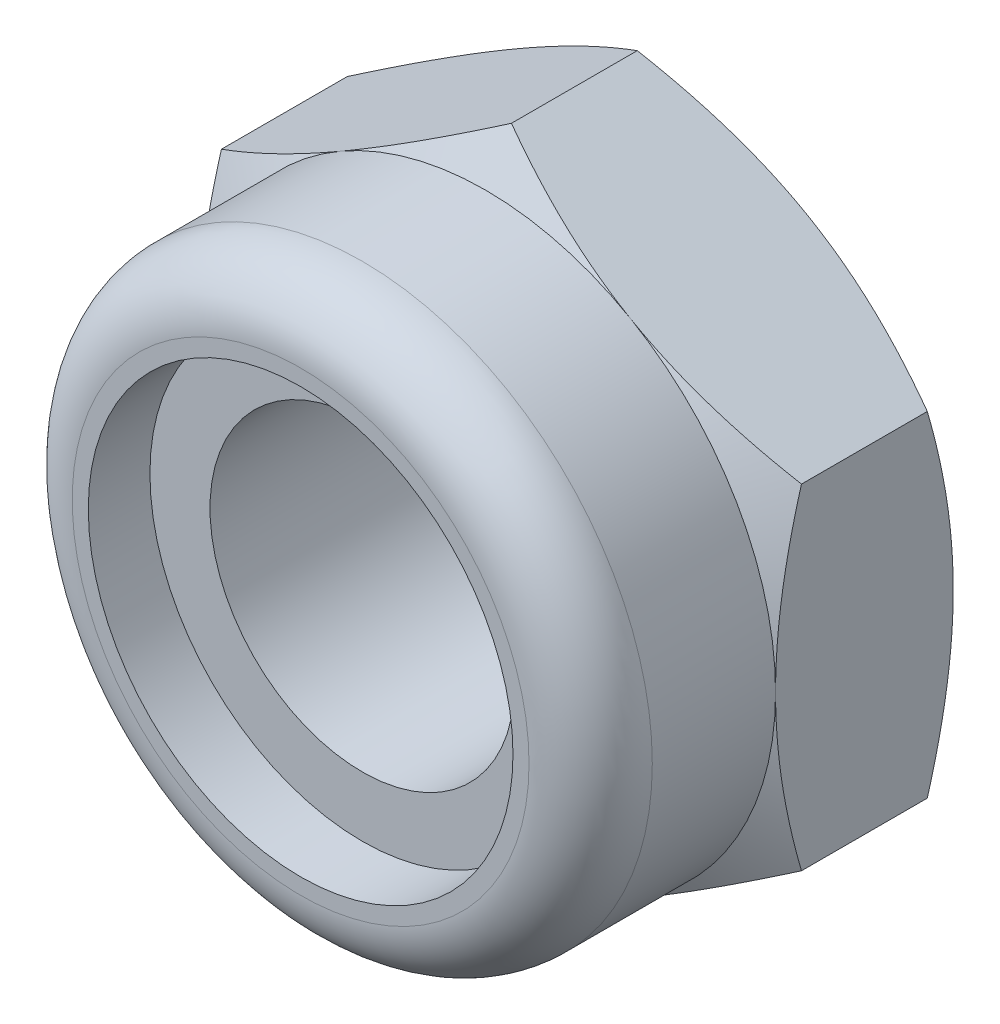
ISO-10303-21;
HEADER;
FILE_DESCRIPTION(('STEP AP214'),'2;1');
FILE_NAME('part.step','',(''),(''),'','','');
FILE_SCHEMA(('AUTOMOTIVE_DESIGN { 1 0 10303 214 1 1 1 1 }'));
ENDSEC;
DATA;
#1=APPLICATION_CONTEXT('core data for automotive mechanical design processes');
#2=APPLICATION_PROTOCOL_DEFINITION('international standard','automotive_design',2000,#1);
#3=PRODUCT_CONTEXT('',#1,'mechanical');
#4=PRODUCT('Part','Part','',(#3));
#5=PRODUCT_RELATED_PRODUCT_CATEGORY('part','',(#4));
#6=PRODUCT_DEFINITION_FORMATION('','',#4);
#7=PRODUCT_DEFINITION_CONTEXT('part definition',#1,'design');
#8=PRODUCT_DEFINITION('design','',#6,#7);
#9=PRODUCT_DEFINITION_SHAPE('','',#8);
#10=(LENGTH_UNIT() NAMED_UNIT(*) SI_UNIT(.MILLI.,.METRE.));
#11=(NAMED_UNIT(*) PLANE_ANGLE_UNIT() SI_UNIT($,.RADIAN.));
#12=(NAMED_UNIT(*) SI_UNIT($,.STERADIAN.) SOLID_ANGLE_UNIT());
#13=UNCERTAINTY_MEASURE_WITH_UNIT(LENGTH_MEASURE(1.E-05),#10,'distance_accuracy_value','');
#14=(GEOMETRIC_REPRESENTATION_CONTEXT(3) GLOBAL_UNCERTAINTY_ASSIGNED_CONTEXT((#13)) GLOBAL_UNIT_ASSIGNED_CONTEXT((#10,
#11,#12)) REPRESENTATION_CONTEXT('',''));
#15=CARTESIAN_POINT('',(0.,0.,0.));
#16=DIRECTION('',(0.,0.,1.));
#17=DIRECTION('',(1.,0.,0.));
#18=AXIS2_PLACEMENT_3D('',#15,#16,#17);
#19=CARTESIAN_POINT('',(0.,0.,-2.45));
#20=DIRECTION('',(0.,0.,1.));
#21=DIRECTION('',(1.,0.,0.));
#22=AXIS2_PLACEMENT_3D('',#19,#20,#21);
#23=CYLINDRICAL_SURFACE('',#22,2.1);
#24=CARTESIAN_POINT('',(0.,0.,1.7));
#25=DIRECTION('',(0.,0.,1.));
#26=DIRECTION('',(1.,0.,0.));
#27=AXIS2_PLACEMENT_3D('',#24,#25,#26);
#28=CIRCLE('',#27,2.1);
#29=CARTESIAN_POINT('',(2.1,0.,1.7));
#30=VERTEX_POINT('',#29);
#31=EDGE_CURVE('E286',#30,#30,#28,.T.);
#32=ORIENTED_EDGE('',*,*,#31,.T.);
#33=EDGE_LOOP('',(#32));
#34=FACE_BOUND('',#33,.T.);
#35=CARTESIAN_POINT('',(0.,0.,-2.14451698471611));
#36=DIRECTION('',(0.,0.,-1.));
#37=DIRECTION('',(-1.,0.,0.));
#38=AXIS2_PLACEMENT_3D('',#35,#36,#37);
#39=CIRCLE('',#38,2.1);
#40=CARTESIAN_POINT('',(-2.1,0.,-2.14451698471611));
#41=VERTEX_POINT('',#40);
#42=EDGE_CURVE('E40',#41,#41,#39,.F.);
#43=ORIENTED_EDGE('',*,*,#42,.F.);
#44=EDGE_LOOP('',(#43));
#45=FACE_BOUND('',#44,.T.);
#46=ADVANCED_FACE('F35',(#34,#45),#23,.F.);
#47=CARTESIAN_POINT('',(0.,4.61880215351701,-2.45));
#48=DIRECTION('',(-0.500000000000001,0.866025403784438,0.));
#49=DIRECTION('',(-0.866025403784438,-0.500000000000001,0.));
#50=AXIS2_PLACEMENT_3D('',#47,#48,#49);
#51=PLANE('',#50);
#52=DIRECTION('',(0.,0.,1.));
#53=VECTOR('',#52,1.);
#54=CARTESIAN_POINT('',(-4.,2.3094010767585,-2.45));
#55=LINE('',#54,#53);
#56=CARTESIAN_POINT('',(-4.,2.30940107675851,-2.09273441009184));
#57=VERTEX_POINT('',#56);
#58=CARTESIAN_POINT('',(-4.,2.3094010767585,-0.357265589908163));
#59=VERTEX_POINT('',#58);
#60=EDGE_CURVE('E258',#57,#59,#55,.T.);
#61=ORIENTED_EDGE('',*,*,#60,.T.);
#62=CARTESIAN_POINT('',(-4.0002,2.30928560670466,-0.357332259074767));
#63=CARTESIAN_POINT('',(-3.82442084967677,2.4107717464617,-0.298717873648282));
#64=CARTESIAN_POINT('',(-3.64712438367362,2.51313390883499,-0.245410321462262));
#65=CARTESIAN_POINT('',(-3.28946140682429,2.71963072479811,-0.152361670746403));
#66=CARTESIAN_POINT('',(-3.10908854102985,2.82376904741904,-0.112653489029704));
#67=CARTESIAN_POINT('',(-2.75057818129721,3.03075510011795,-0.0508422152802782));
#68=CARTESIAN_POINT('',(-2.57249584706486,3.13357098372492,-0.0283277315228877));
#69=CARTESIAN_POINT('',(-2.21549328283349,3.33968651028528,-0.00145062314658057));
#70=CARTESIAN_POINT('',(-2.0365743503559,3.44298540411434,0.00293425857305783));
#71=CARTESIAN_POINT('',(-1.70225715780327,3.63600352522932,-0.00619007293996946));
#72=CARTESIAN_POINT('',(-1.54680884001293,3.72575165335065,-0.0174589539879935));
#73=CARTESIAN_POINT('',(-1.23692494436494,3.90466320392054,-0.0531739907981928));
#74=CARTESIAN_POINT('',(-1.08249043825587,3.99382600759479,-0.077632345711533));
#75=CARTESIAN_POINT('',(-0.771967672225421,4.17310641015197,-0.13877606491929));
#76=CARTESIAN_POINT('',(-0.615918711936897,4.26320131938131,-0.175720603654864));
#77=CARTESIAN_POINT('',(-0.30614816459616,4.44204742827551,-0.259570072548029));
#78=CARTESIAN_POINT('',(-0.15242260922622,4.53080091904966,-0.306455302212742));
#79=CARTESIAN_POINT('',(0.000200000000000819,4.61891762357085,-0.357332259074769));
#80=B_SPLINE_CURVE_WITH_KNOTS('',3,(#62,#63,#64,#65,#66,#67,#68,#69,#70,#71,#72,#73,#74,#75,#76,
#77,#78,#79),.UNSPECIFIED.,.F.,.F.,(4,2,2,2,2,2,2,2,4),(0.,0.634047835695967,1.26961969224544,
1.88946157213122,2.50854226669297,3.04757825393386,3.58711366126904,4.13861653143764,
4.68903648037743),.UNSPECIFIED.);
#81=CARTESIAN_POINT('',(-2.,3.46410161513775,0.));
#82=VERTEX_POINT('',#81);
#83=EDGE_CURVE('E62',#59,#82,#80,.T.);
#84=ORIENTED_EDGE('',*,*,#83,.T.);
#85=CARTESIAN_POINT('',(0.,4.61880215351701,-0.357265589908165));
#86=VERTEX_POINT('',#85);
#87=EDGE_CURVE('E141',#82,#86,#80,.T.);
#88=ORIENTED_EDGE('',*,*,#87,.T.);
#89=DIRECTION('',(0.,0.,1.));
#90=VECTOR('',#89,1.);
#91=CARTESIAN_POINT('',(0.,4.61880215351701,-2.45));
#92=LINE('',#91,#90);
#93=CARTESIAN_POINT('',(0.,4.61880215351701,-2.09273441009184));
#94=VERTEX_POINT('',#93);
#95=EDGE_CURVE('E138',#94,#86,#92,.T.);
#96=ORIENTED_EDGE('',*,*,#95,.F.);
#97=CARTESIAN_POINT('',(-4.0002,2.30928560670466,-2.09266774092523));
#98=CARTESIAN_POINT('',(-3.82442084967677,2.4107717464617,-2.15128212635172));
#99=CARTESIAN_POINT('',(-3.64712438367362,2.51313390883499,-2.20458967853774));
#100=CARTESIAN_POINT('',(-3.28946140682429,2.71963072479811,-2.2976383292536));
#101=CARTESIAN_POINT('',(-3.10908854102985,2.82376904741904,-2.3373465109703));
#102=CARTESIAN_POINT('',(-2.75057818129721,3.03075510011795,-2.39915778471972));
#103=CARTESIAN_POINT('',(-2.57249584706486,3.13357098372492,-2.42167226847711));
#104=CARTESIAN_POINT('',(-2.21549328283349,3.33968651028528,-2.44854937685342));
#105=CARTESIAN_POINT('',(-2.0365743503559,3.44298540411434,-2.45293425857306));
#106=CARTESIAN_POINT('',(-1.70225715780327,3.63600352522932,-2.44380992706003));
#107=CARTESIAN_POINT('',(-1.54680884001293,3.72575165335065,-2.43254104601201));
#108=CARTESIAN_POINT('',(-1.23692494436494,3.90466320392054,-2.39682600920181));
#109=CARTESIAN_POINT('',(-1.08249043825587,3.99382600759479,-2.37236765428847));
#110=CARTESIAN_POINT('',(-0.771967672225421,4.17310641015197,-2.31122393508071));
#111=CARTESIAN_POINT('',(-0.615918711936897,4.26320131938131,-2.27427939634514));
#112=CARTESIAN_POINT('',(-0.30614816459616,4.4420474282755,-2.19042992745197));
#113=CARTESIAN_POINT('',(-0.15242260922622,4.53080091904966,-2.14354469778726));
#114=CARTESIAN_POINT('',(0.000200000000000819,4.61891762357085,-2.09266774092523));
#115=B_SPLINE_CURVE_WITH_KNOTS('',3,(#97,#98,#99,#100,#101,#102,#103,#104,#105,#106,#107,#108,
#109,#110,#111,#112,#113,#114),.UNSPECIFIED.,.F.,.F.,(4,2,2,2,2,2,2,2,4),(0.,0.634047835695967,
1.26961969224544,1.88946157213122,2.50854226669297,3.04757825393386,3.58711366126904,
4.13861653143764,4.68903648037743),.UNSPECIFIED.);
#116=CARTESIAN_POINT('',(-2.,3.46410161513775,-2.45));
#117=VERTEX_POINT('',#116);
#118=EDGE_CURVE('E261',#117,#94,#115,.T.);
#119=ORIENTED_EDGE('',*,*,#118,.F.);
#120=EDGE_CURVE('E239',#57,#117,#115,.T.);
#121=ORIENTED_EDGE('',*,*,#120,.F.);
#122=EDGE_LOOP('',(#61,#84,#88,#96,#119,#121));
#123=FACE_BOUND('',#122,.T.);
#124=ADVANCED_FACE('F37',(#123),#51,.T.);
#125=CARTESIAN_POINT('',(4.,2.3094010767585,-2.45));
#126=DIRECTION('',(0.500000000000001,0.866025403784438,0.));
#127=DIRECTION('',(-0.866025403784438,0.500000000000001,0.));
#128=AXIS2_PLACEMENT_3D('',#125,#126,#127);
#129=PLANE('',#128);
#130=ORIENTED_EDGE('',*,*,#95,.T.);
#131=CARTESIAN_POINT('',(-0.000199999999999567,4.61891762357085,-0.357332259074769));
#132=CARTESIAN_POINT('',(0.175579150323228,4.51743148381381,-0.298717873648285));
#133=CARTESIAN_POINT('',(0.352875616326381,4.41506932144052,-0.245410321462264));
#134=CARTESIAN_POINT('',(0.710538593175707,4.20857250547739,-0.152361670746404));
#135=CARTESIAN_POINT('',(0.890911458970152,4.10443418285647,-0.112653489029704));
#136=CARTESIAN_POINT('',(1.24942181870279,3.89744813015756,-0.0508422152802783));
#137=CARTESIAN_POINT('',(1.42750415293514,3.79463224655059,-0.028327731522888));
#138=CARTESIAN_POINT('',(1.78450671716651,3.58851671999023,-0.00145062314658078));
#139=CARTESIAN_POINT('',(1.9634256496441,3.48521782616117,0.00293425857305796));
#140=CARTESIAN_POINT('',(2.29774284219673,3.29219970504619,-0.0061900729399691));
#141=CARTESIAN_POINT('',(2.45319115998707,3.20245157692486,-0.0174589539879932));
#142=CARTESIAN_POINT('',(2.76307505563506,3.02354002635496,-0.0531739907981922));
#143=CARTESIAN_POINT('',(2.91750956174413,2.93437722268072,-0.0776323457115321));
#144=CARTESIAN_POINT('',(3.22803232777458,2.75509682012354,-0.138776064919289));
#145=CARTESIAN_POINT('',(3.3840812880631,2.6650019108942,-0.175720603654863));
#146=CARTESIAN_POINT('',(3.69385183540384,2.486155802,-0.259570072548027));
#147=CARTESIAN_POINT('',(3.84757739077378,2.39740231122584,-0.306455302212741));
#148=CARTESIAN_POINT('',(4.0002,2.30928560670466,-0.357332259074767));
#149=B_SPLINE_CURVE_WITH_KNOTS('',3,(#131,#132,#133,#134,#135,#136,#137,#138,#139,#140,#141,
#142,#143,#144,#145,#146,#147,#148),.UNSPECIFIED.,.F.,.F.,(4,2,2,2,2,2,2,2,4),(0.,
0.634047835695968,1.26961969224544,1.88946157213122,2.50854226669297,3.04757825393386,
3.58711366126904,4.13861653143764,4.68903648037743),.UNSPECIFIED.);
#150=CARTESIAN_POINT('',(2.,3.46410161513775,0.));
#151=VERTEX_POINT('',#150);
#152=EDGE_CURVE('E130',#86,#151,#149,.T.);
#153=ORIENTED_EDGE('',*,*,#152,.T.);
#154=CARTESIAN_POINT('',(4.,2.30940107675851,-0.357265589908165));
#155=VERTEX_POINT('',#154);
#156=EDGE_CURVE('E134',#151,#155,#149,.T.);
#157=ORIENTED_EDGE('',*,*,#156,.T.);
#158=DIRECTION('',(0.,0.,1.));
#159=VECTOR('',#158,1.);
#160=CARTESIAN_POINT('',(4.,2.3094010767585,-2.45));
#161=LINE('',#160,#159);
#162=CARTESIAN_POINT('',(4.,2.30940107675851,-2.09273441009184));
#163=VERTEX_POINT('',#162);
#164=EDGE_CURVE('E247',#163,#155,#161,.T.);
#165=ORIENTED_EDGE('',*,*,#164,.F.);
#166=CARTESIAN_POINT('',(-0.000199999999999567,4.61891762357085,-2.09266774092523));
#167=CARTESIAN_POINT('',(0.175579150323228,4.51743148381381,-2.15128212635172));
#168=CARTESIAN_POINT('',(0.352875616326381,4.41506932144052,-2.20458967853774));
#169=CARTESIAN_POINT('',(0.710538593175707,4.20857250547739,-2.2976383292536));
#170=CARTESIAN_POINT('',(0.890911458970152,4.10443418285647,-2.3373465109703));
#171=CARTESIAN_POINT('',(1.24942181870279,3.89744813015756,-2.39915778471972));
#172=CARTESIAN_POINT('',(1.42750415293514,3.79463224655059,-2.42167226847711));
#173=CARTESIAN_POINT('',(1.78450671716651,3.58851671999023,-2.44854937685342));
#174=CARTESIAN_POINT('',(1.9634256496441,3.48521782616117,-2.45293425857306));
#175=CARTESIAN_POINT('',(2.29774284219673,3.29219970504619,-2.44380992706003));
#176=CARTESIAN_POINT('',(2.45319115998707,3.20245157692486,-2.43254104601201));
#177=CARTESIAN_POINT('',(2.76307505563506,3.02354002635496,-2.39682600920181));
#178=CARTESIAN_POINT('',(2.91750956174413,2.93437722268072,-2.37236765428847));
#179=CARTESIAN_POINT('',(3.22803232777458,2.75509682012354,-2.31122393508071));
#180=CARTESIAN_POINT('',(3.3840812880631,2.6650019108942,-2.27427939634514));
#181=CARTESIAN_POINT('',(3.69385183540384,2.486155802,-2.19042992745197));
#182=CARTESIAN_POINT('',(3.84757739077378,2.39740231122584,-2.14354469778726));
#183=CARTESIAN_POINT('',(4.0002,2.30928560670466,-2.09266774092523));
#184=B_SPLINE_CURVE_WITH_KNOTS('',3,(#166,#167,#168,#169,#170,#171,#172,#173,#174,#175,#176,
#177,#178,#179,#180,#181,#182,#183),.UNSPECIFIED.,.F.,.F.,(4,2,2,2,2,2,2,2,4),(0.,
0.634047835695968,1.26961969224544,1.88946157213122,2.50854226669297,3.04757825393386,
3.58711366126904,4.13861653143764,4.68903648037743),.UNSPECIFIED.);
#185=CARTESIAN_POINT('',(2.,3.46410161513775,-2.45));
#186=VERTEX_POINT('',#185);
#187=EDGE_CURVE('E230',#186,#163,#184,.T.);
#188=ORIENTED_EDGE('',*,*,#187,.F.);
#189=EDGE_CURVE('E237',#94,#186,#184,.T.);
#190=ORIENTED_EDGE('',*,*,#189,.F.);
#191=EDGE_LOOP('',(#130,#153,#157,#165,#188,#190));
#192=FACE_BOUND('',#191,.T.);
#193=ADVANCED_FACE('F132',(#192),#129,.T.);
#194=CARTESIAN_POINT('',(4.,2.3094010767585,-2.45));
#195=DIRECTION('',(-1.,0.,0.));
#196=DIRECTION('',(0.,0.,1.));
#197=AXIS2_PLACEMENT_3D('',#194,#195,#196);
#198=PLANE('',#197);
#199=CARTESIAN_POINT('',(4.,-6.12487198995892,-1.91410682124064));
#200=CARTESIAN_POINT('',(4.,-5.94924937038676,-1.8292362707669));
#201=CARTESIAN_POINT('',(4.,-5.77321152095286,-1.7452094038074));
#202=CARTESIAN_POINT('',(4.,-5.42008084777955,-1.57932514679717));
#203=CARTESIAN_POINT('',(4.,-5.24298784779928,-1.49746813236723));
#204=CARTESIAN_POINT('',(4.,-4.88656571686334,-1.33597446305856));
#205=CARTESIAN_POINT('',(4.,-4.70722958889362,-1.25635319506304));
#206=CARTESIAN_POINT('',(4.,-4.34708334747263,-1.1005305854203));
#207=CARTESIAN_POINT('',(4.,-4.16627331143538,-1.02432906550802));
#208=CARTESIAN_POINT('',(4.,-3.80064706744978,-0.875350650394363));
#209=CARTESIAN_POINT('',(4.,-3.6158089282277,-0.802627284215846));
#210=CARTESIAN_POINT('',(4.,-3.24395246794969,-0.66287623095942));
#211=CARTESIAN_POINT('',(4.,-3.05693390695801,-0.595849177566505));
#212=CARTESIAN_POINT('',(4.,-2.68080318253771,-0.469291748430882));
#213=CARTESIAN_POINT('',(4.,-2.49169643712849,-0.409745434783837));
#214=CARTESIAN_POINT('',(4.,-2.11079454635851,-0.300083356544506));
#215=CARTESIAN_POINT('',(4.,-1.91900027185749,-0.249964609676752));
#216=CARTESIAN_POINT('',(4.,-1.532592326982,-0.161590794954042));
#217=CARTESIAN_POINT('',(4.,-1.3379779203165,-0.12333888595654));
#218=CARTESIAN_POINT('',(4.,-0.946402725872554,-0.061274235922343));
#219=CARTESIAN_POINT('',(4.,-0.749441936019774,-0.0374615076516983));
#220=CARTESIAN_POINT('',(4.,-0.355451989627943,-0.00638181314943566));
#221=CARTESIAN_POINT('',(4.,-0.158431311094012,0.000989900761041732));
#222=CARTESIAN_POINT('',(4.,0.235472085607469,-0.00120406637479526));
#223=CARTESIAN_POINT('',(4.,0.432354826312205,-0.0107653508153501));
#224=CARTESIAN_POINT('',(4.,0.768560635225516,-0.0408787346135905));
#225=CARTESIAN_POINT('',(4.,0.908254618381819,-0.0575092960439099));
#226=CARTESIAN_POINT('',(4.,1.18656349063497,-0.0982134103466919));
#227=CARTESIAN_POINT('',(4.,1.32517820601013,-0.122288137058446));
#228=CARTESIAN_POINT('',(4.,1.73929045452969,-0.204415070950231));
#229=CARTESIAN_POINT('',(4.,2.01284690528722,-0.272348886425154));
#230=CARTESIAN_POINT('',(4.,2.42218253014524,-0.389516359317204));
#231=CARTESIAN_POINT('',(4.,2.56009536361539,-0.431713941811637));
#232=CARTESIAN_POINT('',(4.,2.83448159101404,-0.520284580227763));
#233=CARTESIAN_POINT('',(4.,2.97095590623557,-0.566654756186913));
#234=CARTESIAN_POINT('',(4.,3.24189440516341,-0.662605699180287));
#235=CARTESIAN_POINT('',(4.,3.37636557946838,-0.712166925753501));
#236=CARTESIAN_POINT('',(4.,3.64426461152914,-0.814198353790703));
#237=CARTESIAN_POINT('',(4.,3.77769202239387,-0.866669730963371));
#238=CARTESIAN_POINT('',(4.,3.91063698986684,-0.920309006541794));
#239=B_SPLINE_CURVE_WITH_KNOTS('',3,(#199,#200,#201,#202,#203,#204,#205,#206,#207,#208,#209,
#210,#211,#212,#213,#214,#215,#216,#217,#218,#219,#220,#221,#222,#223,#224,#225,#226,#227,#228,
#229,#230,#231,#232,#233,#234,#235,#236,#237,#238),.UNSPECIFIED.,.F.,.F.,(4,2,2,2,2,2,2,2,2,2,2,
2,2,2,2,2,2,2,2,4),(0.,0.58517179253227,1.17044423059927,1.75906594645989,2.34765694284827,
2.94347400997483,3.53935727210689,4.13394864697601,4.72835161391471,5.32291267067845,
5.91747425310813,6.50823685854037,7.09884609659886,7.52068140825521,7.9425832713084,
8.7870149135983,9.21965281897689,9.65199437116297,10.0819024146297,10.5119854255247),.UNSPECIFIED.);
#240=CARTESIAN_POINT('',(4.,-2.30940107675851,-0.357265589908165));
#241=VERTEX_POINT('',#240);
#242=CARTESIAN_POINT('',(4.,0.,0.));
#243=VERTEX_POINT('',#242);
#244=EDGE_CURVE('E203',#241,#243,#239,.T.);
#245=ORIENTED_EDGE('',*,*,#244,.F.);
#246=DIRECTION('',(0.,0.,1.));
#247=VECTOR('',#246,1.);
#248=CARTESIAN_POINT('',(4.,-2.30940107675851,-2.45));
#249=LINE('',#248,#247);
#250=CARTESIAN_POINT('',(4.,-2.30940107675851,-2.09273441009184));
#251=VERTEX_POINT('',#250);
#252=EDGE_CURVE('E249',#251,#241,#249,.T.);
#253=ORIENTED_EDGE('',*,*,#252,.F.);
#254=CARTESIAN_POINT('',(4.,-6.12487198995892,-0.535893178759358));
#255=CARTESIAN_POINT('',(4.,-5.94924937038676,-0.620763729233101));
#256=CARTESIAN_POINT('',(4.,-5.77321152095286,-0.704790596192602));
#257=CARTESIAN_POINT('',(4.,-5.42008084777954,-0.870674853202836));
#258=CARTESIAN_POINT('',(4.,-5.24298784779928,-0.952531867632769));
#259=CARTESIAN_POINT('',(4.,-4.88656571686334,-1.11402553694144));
#260=CARTESIAN_POINT('',(4.,-4.70722958889362,-1.19364680493696));
#261=CARTESIAN_POINT('',(4.,-4.34708334747263,-1.3494694145797));
#262=CARTESIAN_POINT('',(4.,-4.16627331143537,-1.42567093449198));
#263=CARTESIAN_POINT('',(4.,-3.80064706744977,-1.57464934960564));
#264=CARTESIAN_POINT('',(4.,-3.6158089282277,-1.64737271578416));
#265=CARTESIAN_POINT('',(4.,-3.24395246794968,-1.78712376904058));
#266=CARTESIAN_POINT('',(4.,-3.05693390695801,-1.8541508224335));
#267=CARTESIAN_POINT('',(4.,-2.6808031825377,-1.98070825156912));
#268=CARTESIAN_POINT('',(4.,-2.49169643712848,-2.04025456521616));
#269=CARTESIAN_POINT('',(4.,-2.11079454635851,-2.14991664345549));
#270=CARTESIAN_POINT('',(4.,-1.91900027185749,-2.20003539032325));
#271=CARTESIAN_POINT('',(4.,-1.532592326982,-2.28840920504596));
#272=CARTESIAN_POINT('',(4.,-1.3379779203165,-2.32666111404346));
#273=CARTESIAN_POINT('',(4.,-0.946402725872555,-2.38872576407766));
#274=CARTESIAN_POINT('',(4.,-0.749441936019774,-2.4125384923483));
#275=CARTESIAN_POINT('',(4.,-0.355451989627943,-2.44361818685056));
#276=CARTESIAN_POINT('',(4.,-0.158431311094012,-2.45098990076104));
#277=CARTESIAN_POINT('',(4.,0.235472085607468,-2.44879593362521));
#278=CARTESIAN_POINT('',(4.,0.432354826312205,-2.43923464918465));
#279=CARTESIAN_POINT('',(4.,0.768560635225517,-2.40912126538641));
#280=CARTESIAN_POINT('',(4.,0.90825461838182,-2.39249070395609));
#281=CARTESIAN_POINT('',(4.,1.18656349063497,-2.35178658965331));
#282=CARTESIAN_POINT('',(4.,1.32517820601013,-2.32771186294155));
#283=CARTESIAN_POINT('',(4.,1.73929045452969,-2.24558492904977));
#284=CARTESIAN_POINT('',(4.,2.01284690528722,-2.17765111357485));
#285=CARTESIAN_POINT('',(4.,2.42218253014524,-2.0604836406828));
#286=CARTESIAN_POINT('',(4.,2.56009536361539,-2.01828605818836));
#287=CARTESIAN_POINT('',(4.,2.83448159101404,-1.92971541977224));
#288=CARTESIAN_POINT('',(4.,2.97095590623558,-1.88334524381309));
#289=CARTESIAN_POINT('',(4.,3.24189440516341,-1.78739430081971));
#290=CARTESIAN_POINT('',(4.,3.37636557946838,-1.7378330742465));
#291=CARTESIAN_POINT('',(4.,3.64426461152914,-1.6358016462093));
#292=CARTESIAN_POINT('',(4.,3.77769202239387,-1.58333026903663));
#293=CARTESIAN_POINT('',(4.,3.91063698986684,-1.52969099345821));
#294=B_SPLINE_CURVE_WITH_KNOTS('',3,(#254,#255,#256,#257,#258,#259,#260,#261,#262,#263,#264,
#265,#266,#267,#268,#269,#270,#271,#272,#273,#274,#275,#276,#277,#278,#279,#280,#281,#282,#283,
#284,#285,#286,#287,#288,#289,#290,#291,#292,#293),.UNSPECIFIED.,.F.,.F.,(4,2,2,2,2,2,2,2,2,2,2,
2,2,2,2,2,2,2,2,4),(0.,0.585171792532273,1.17044423059927,1.7590659464599,2.34765694284827,
2.94347400997484,3.53935727210689,4.13394864697601,4.72835161391471,5.32291267067845,
5.91747425310813,6.50823685854037,7.09884609659886,7.52068140825522,7.9425832713084,
8.7870149135983,9.2196528189769,9.65199437116298,10.0819024146297,10.5119854255247),.UNSPECIFIED.);
#295=CARTESIAN_POINT('',(4.,0.,-2.45));
#296=VERTEX_POINT('',#295);
#297=EDGE_CURVE('E395',#251,#296,#294,.T.);
#298=ORIENTED_EDGE('',*,*,#297,.T.);
#299=EDGE_CURVE('E238',#296,#163,#294,.T.);
#300=ORIENTED_EDGE('',*,*,#299,.T.);
#301=ORIENTED_EDGE('',*,*,#164,.T.);
#302=EDGE_CURVE('E148',#243,#155,#239,.T.);
#303=ORIENTED_EDGE('',*,*,#302,.F.);
#304=EDGE_LOOP('',(#245,#253,#298,#300,#301,#303));
#305=FACE_BOUND('',#304,.T.);
#306=ADVANCED_FACE('F225',(#305),#198,.F.);
#307=CARTESIAN_POINT('',(0.,-4.61880215351701,-2.45));
#308=DIRECTION('',(0.500000000000001,-0.866025403784438,0.));
#309=DIRECTION('',(0.866025403784438,0.500000000000001,0.));
#310=AXIS2_PLACEMENT_3D('',#307,#308,#309);
#311=PLANE('',#310);
#312=ORIENTED_EDGE('',*,*,#252,.T.);
#313=CARTESIAN_POINT('',(4.0002,-2.30928560670467,-0.357332259074769));
#314=CARTESIAN_POINT('',(3.82442084967677,-2.41077174646171,-0.298717873648285));
#315=CARTESIAN_POINT('',(3.64712438367362,-2.513133908835,-0.245410321462264));
#316=CARTESIAN_POINT('',(3.28946140682429,-2.71963072479812,-0.152361670746405));
#317=CARTESIAN_POINT('',(3.10908854102985,-2.82376904741905,-0.112653489029705));
#318=CARTESIAN_POINT('',(2.75057818129721,-3.03075510011796,-0.0508422152802802));
#319=CARTESIAN_POINT('',(2.57249584706486,-3.13357098372492,-0.0283277315228902));
#320=CARTESIAN_POINT('',(2.21549328283349,-3.33968651028529,-0.00145062314658357));
#321=CARTESIAN_POINT('',(2.0365743503559,-3.44298540411435,0.00293425857305496));
#322=CARTESIAN_POINT('',(1.70225715780326,-3.63600352522933,-0.00619007293997268));
#323=CARTESIAN_POINT('',(1.54680884001293,-3.72575165335065,-0.0174589539879971));
#324=CARTESIAN_POINT('',(1.23692494436494,-3.90466320392055,-0.0531739907981967));
#325=CARTESIAN_POINT('',(1.08249043825587,-3.99382600759479,-0.0776323457115368));
#326=CARTESIAN_POINT('',(0.77196767222542,-4.17310641015198,-0.138776064919294));
#327=CARTESIAN_POINT('',(0.615918711936897,-4.26320131938132,-0.175720603654868));
#328=CARTESIAN_POINT('',(0.30614816459616,-4.44204742827551,-0.259570072548032));
#329=CARTESIAN_POINT('',(0.15242260922622,-4.53080091904967,-0.306455302212746));
#330=CARTESIAN_POINT('',(-0.000200000000000203,-4.61891762357085,-0.357332259074773));
#331=B_SPLINE_CURVE_WITH_KNOTS('',3,(#313,#314,#315,#316,#317,#318,#319,#320,#321,#322,#323,
#324,#325,#326,#327,#328,#329,#330),.UNSPECIFIED.,.F.,.F.,(4,2,2,2,2,2,2,2,4),(0.,
0.634047835695967,1.26961969224544,1.88946157213122,2.50854226669298,3.04757825393386,
3.58711366126904,4.13861653143764,4.68903648037743),.UNSPECIFIED.);
#332=CARTESIAN_POINT('',(2.,-3.46410161513775,0.));
#333=VERTEX_POINT('',#332);
#334=EDGE_CURVE('E333',#241,#333,#331,.T.);
#335=ORIENTED_EDGE('',*,*,#334,.T.);
#336=CARTESIAN_POINT('',(0.,-4.61880215351701,-0.357265589908165));
#337=VERTEX_POINT('',#336);
#338=EDGE_CURVE('E196',#333,#337,#331,.T.);
#339=ORIENTED_EDGE('',*,*,#338,.T.);
#340=DIRECTION('',(0.,0.,1.));
#341=VECTOR('',#340,1.);
#342=CARTESIAN_POINT('',(0.,-4.61880215351701,-2.45));
#343=LINE('',#342,#341);
#344=CARTESIAN_POINT('',(0.,-4.61880215351701,-2.09273441009184));
#345=VERTEX_POINT('',#344);
#346=EDGE_CURVE('E252',#345,#337,#343,.T.);
#347=ORIENTED_EDGE('',*,*,#346,.F.);
#348=CARTESIAN_POINT('',(4.0002,-2.30928560670467,-2.09266774092523));
#349=CARTESIAN_POINT('',(3.82442084967677,-2.41077174646171,-2.15128212635172));
#350=CARTESIAN_POINT('',(3.64712438367362,-2.513133908835,-2.20458967853774));
#351=CARTESIAN_POINT('',(3.28946140682429,-2.71963072479812,-2.2976383292536));
#352=CARTESIAN_POINT('',(3.10908854102985,-2.82376904741905,-2.3373465109703));
#353=CARTESIAN_POINT('',(2.75057818129721,-3.03075510011796,-2.39915778471972));
#354=CARTESIAN_POINT('',(2.57249584706486,-3.13357098372492,-2.42167226847711));
#355=CARTESIAN_POINT('',(2.21549328283349,-3.33968651028529,-2.44854937685342));
#356=CARTESIAN_POINT('',(2.0365743503559,-3.44298540411435,-2.45293425857306));
#357=CARTESIAN_POINT('',(1.70225715780326,-3.63600352522933,-2.44380992706003));
#358=CARTESIAN_POINT('',(1.54680884001293,-3.72575165335065,-2.432541046012));
#359=CARTESIAN_POINT('',(1.23692494436494,-3.90466320392055,-2.3968260092018));
#360=CARTESIAN_POINT('',(1.08249043825587,-3.99382600759479,-2.37236765428846));
#361=CARTESIAN_POINT('',(0.77196767222542,-4.17310641015198,-2.31122393508071));
#362=CARTESIAN_POINT('',(0.615918711936897,-4.26320131938132,-2.27427939634513));
#363=CARTESIAN_POINT('',(0.30614816459616,-4.44204742827551,-2.19042992745197));
#364=CARTESIAN_POINT('',(0.15242260922622,-4.53080091904967,-2.14354469778725));
#365=CARTESIAN_POINT('',(-0.000200000000000195,-4.61891762357085,-2.09266774092523));
#366=B_SPLINE_CURVE_WITH_KNOTS('',3,(#348,#349,#350,#351,#352,#353,#354,#355,#356,#357,#358,
#359,#360,#361,#362,#363,#364,#365),.UNSPECIFIED.,.F.,.F.,(4,2,2,2,2,2,2,2,4),(0.,
0.634047835695967,1.26961969224544,1.88946157213122,2.50854226669298,3.04757825393386,
3.58711366126904,4.13861653143764,4.68903648037743),.UNSPECIFIED.);
#367=CARTESIAN_POINT('',(2.,-3.46410161513775,-2.45));
#368=VERTEX_POINT('',#367);
#369=EDGE_CURVE('E369',#368,#345,#366,.T.);
#370=ORIENTED_EDGE('',*,*,#369,.F.);
#371=EDGE_CURVE('E394',#251,#368,#366,.T.);
#372=ORIENTED_EDGE('',*,*,#371,.F.);
#373=EDGE_LOOP('',(#312,#335,#339,#347,#370,#372));
#374=FACE_BOUND('',#373,.T.);
#375=ADVANCED_FACE('F385',(#374),#311,.T.);
#376=CARTESIAN_POINT('',(-4.,-2.30940107675851,-2.45));
#377=DIRECTION('',(-0.500000000000001,-0.866025403784438,0.));
#378=DIRECTION('',(0.866025403784438,-0.500000000000001,0.));
#379=AXIS2_PLACEMENT_3D('',#376,#377,#378);
#380=PLANE('',#379);
#381=ORIENTED_EDGE('',*,*,#346,.T.);
#382=CARTESIAN_POINT('',(0.00019999999999975,-4.61891762357085,-0.357332259074773));
#383=CARTESIAN_POINT('',(-0.175579150323228,-4.51743148381381,-0.298717873648288));
#384=CARTESIAN_POINT('',(-0.352875616326381,-4.41506932144052,-0.245410321462267));
#385=CARTESIAN_POINT('',(-0.710538593175708,-4.2085725054774,-0.152361670746407));
#386=CARTESIAN_POINT('',(-0.890911458970153,-4.10443418285647,-0.112653489029708));
#387=CARTESIAN_POINT('',(-1.24942181870279,-3.89744813015756,-0.0508422152802818));
#388=CARTESIAN_POINT('',(-1.42750415293515,-3.7946322465506,-0.0283277315228914));
#389=CARTESIAN_POINT('',(-1.78450671716651,-3.58851671999023,-0.00145062314658389));
#390=CARTESIAN_POINT('',(-1.9634256496441,-3.48521782616117,0.00293425857305508));
#391=CARTESIAN_POINT('',(-2.29774284219674,-3.29219970504619,-0.00619007293997197));
#392=CARTESIAN_POINT('',(-2.45319115998707,-3.20245157692487,-0.0174589539879962));
#393=CARTESIAN_POINT('',(-2.76307505563506,-3.02354002635497,-0.0531739907981951));
#394=CARTESIAN_POINT('',(-2.91750956174413,-2.93437722268073,-0.0776323457115348));
#395=CARTESIAN_POINT('',(-3.22803232777458,-2.75509682012354,-0.138776064919291));
#396=CARTESIAN_POINT('',(-3.3840812880631,-2.6650019108942,-0.175720603654865));
#397=CARTESIAN_POINT('',(-3.69385183540384,-2.48615580200001,-0.259570072548029));
#398=CARTESIAN_POINT('',(-3.84757739077378,-2.39740231122585,-0.306455302212742));
#399=CARTESIAN_POINT('',(-4.0002,-2.30928560670467,-0.357332259074769));
#400=B_SPLINE_CURVE_WITH_KNOTS('',3,(#382,#383,#384,#385,#386,#387,#388,#389,#390,#391,#392,
#393,#394,#395,#396,#397,#398,#399),.UNSPECIFIED.,.F.,.F.,(4,2,2,2,2,2,2,2,4),(0.,
0.634047835695968,1.26961969224544,1.88946157213123,2.50854226669298,3.04757825393386,
3.58711366126904,4.13861653143764,4.68903648037743),.UNSPECIFIED.);
#401=CARTESIAN_POINT('',(-2.,-3.46410161513775,0.));
#402=VERTEX_POINT('',#401);
#403=EDGE_CURVE('E326',#337,#402,#400,.T.);
#404=ORIENTED_EDGE('',*,*,#403,.T.);
#405=CARTESIAN_POINT('',(-4.,-2.30940107675851,-0.357265589908165));
#406=VERTEX_POINT('',#405);
#407=EDGE_CURVE('E169',#402,#406,#400,.T.);
#408=ORIENTED_EDGE('',*,*,#407,.T.);
#409=DIRECTION('',(0.,0.,1.));
#410=VECTOR('',#409,1.);
#411=CARTESIAN_POINT('',(-4.,-2.30940107675851,-2.45));
#412=LINE('',#411,#410);
#413=CARTESIAN_POINT('',(-4.,-2.30940107675851,-2.09273441009184));
#414=VERTEX_POINT('',#413);
#415=EDGE_CURVE('E255',#414,#406,#412,.T.);
#416=ORIENTED_EDGE('',*,*,#415,.F.);
#417=CARTESIAN_POINT('',(0.00019999999999975,-4.61891762357085,-2.09266774092523));
#418=CARTESIAN_POINT('',(-0.175579150323229,-4.51743148381381,-2.15128212635171));
#419=CARTESIAN_POINT('',(-0.352875616326382,-4.41506932144052,-2.20458967853773));
#420=CARTESIAN_POINT('',(-0.710538593175708,-4.2085725054774,-2.29763832925359));
#421=CARTESIAN_POINT('',(-0.890911458970153,-4.10443418285647,-2.33734651097029));
#422=CARTESIAN_POINT('',(-1.24942181870279,-3.89744813015756,-2.39915778471972));
#423=CARTESIAN_POINT('',(-1.42750415293515,-3.7946322465506,-2.42167226847711));
#424=CARTESIAN_POINT('',(-1.78450671716651,-3.58851671999023,-2.44854937685342));
#425=CARTESIAN_POINT('',(-1.9634256496441,-3.48521782616117,-2.45293425857306));
#426=CARTESIAN_POINT('',(-2.29774284219674,-3.29219970504619,-2.44380992706003));
#427=CARTESIAN_POINT('',(-2.45319115998707,-3.20245157692487,-2.432541046012));
#428=CARTESIAN_POINT('',(-2.76307505563506,-3.02354002635497,-2.39682600920181));
#429=CARTESIAN_POINT('',(-2.91750956174413,-2.93437722268073,-2.37236765428847));
#430=CARTESIAN_POINT('',(-3.22803232777458,-2.75509682012354,-2.31122393508071));
#431=CARTESIAN_POINT('',(-3.3840812880631,-2.6650019108942,-2.27427939634513));
#432=CARTESIAN_POINT('',(-3.69385183540384,-2.48615580200001,-2.19042992745197));
#433=CARTESIAN_POINT('',(-3.84757739077378,-2.39740231122585,-2.14354469778726));
#434=CARTESIAN_POINT('',(-4.0002,-2.30928560670467,-2.09266774092523));
#435=B_SPLINE_CURVE_WITH_KNOTS('',3,(#417,#418,#419,#420,#421,#422,#423,#424,#425,#426,#427,
#428,#429,#430,#431,#432,#433,#434),.UNSPECIFIED.,.F.,.F.,(4,2,2,2,2,2,2,2,4),(0.,
0.634047835695968,1.26961969224544,1.88946157213123,2.50854226669298,3.04757825393386,
3.58711366126904,4.13861653143764,4.68903648037744),.UNSPECIFIED.);
#436=CARTESIAN_POINT('',(-2.,-3.46410161513775,-2.45));
#437=VERTEX_POINT('',#436);
#438=EDGE_CURVE('E363',#437,#414,#435,.T.);
#439=ORIENTED_EDGE('',*,*,#438,.F.);
#440=EDGE_CURVE('E364',#345,#437,#435,.T.);
#441=ORIENTED_EDGE('',*,*,#440,.F.);
#442=EDGE_LOOP('',(#381,#404,#408,#416,#439,#441));
#443=FACE_BOUND('',#442,.T.);
#444=ADVANCED_FACE('F329',(#443),#380,.T.);
#445=CARTESIAN_POINT('',(-4.,2.3094010767585,-2.45));
#446=DIRECTION('',(-1.,0.,0.));
#447=DIRECTION('',(0.,0.,1.));
#448=AXIS2_PLACEMENT_3D('',#445,#446,#447);
#449=PLANE('',#448);
#450=ORIENTED_EDGE('',*,*,#415,.T.);
#451=CARTESIAN_POINT('',(-4.,-6.12487198995892,-1.91410682124064));
#452=CARTESIAN_POINT('',(-4.,-5.94924937038676,-1.8292362707669));
#453=CARTESIAN_POINT('',(-4.,-5.77321152095286,-1.7452094038074));
#454=CARTESIAN_POINT('',(-4.,-5.42008084777954,-1.57932514679716));
#455=CARTESIAN_POINT('',(-4.,-5.24298784779928,-1.49746813236723));
#456=CARTESIAN_POINT('',(-4.,-4.88656571686334,-1.33597446305856));
#457=CARTESIAN_POINT('',(-4.,-4.70722958889362,-1.25635319506304));
#458=CARTESIAN_POINT('',(-4.,-4.34708334747263,-1.1005305854203));
#459=CARTESIAN_POINT('',(-4.,-4.16627331143537,-1.02432906550802));
#460=CARTESIAN_POINT('',(-4.,-3.80064706744978,-0.875350650394363));
#461=CARTESIAN_POINT('',(-4.,-3.6158089282277,-0.802627284215846));
#462=CARTESIAN_POINT('',(-4.,-3.24395246794968,-0.66287623095942));
#463=CARTESIAN_POINT('',(-4.,-3.05693390695801,-0.595849177566504));
#464=CARTESIAN_POINT('',(-4.,-2.68080318253771,-0.469291748430881));
#465=CARTESIAN_POINT('',(-4.,-2.49169643712849,-0.409745434783837));
#466=CARTESIAN_POINT('',(-4.,-2.11079454635851,-0.300083356544506));
#467=CARTESIAN_POINT('',(-4.,-1.91900027185749,-0.249964609676751));
#468=CARTESIAN_POINT('',(-4.,-1.532592326982,-0.161590794954041));
#469=CARTESIAN_POINT('',(-4.,-1.3379779203165,-0.123338885956539));
#470=CARTESIAN_POINT('',(-4.,-0.946402725872553,-0.0612742359223426));
#471=CARTESIAN_POINT('',(-4.,-0.749441936019772,-0.0374615076516982));
#472=CARTESIAN_POINT('',(-4.,-0.355451989627941,-0.00638181314943576));
#473=CARTESIAN_POINT('',(-4.,-0.15843131109401,0.000989900761041879));
#474=CARTESIAN_POINT('',(-4.,0.23547208560747,-0.00120406637479541));
#475=CARTESIAN_POINT('',(-4.,0.432354826312206,-0.0107653508153508));
#476=CARTESIAN_POINT('',(-4.,0.768560635225518,-0.0408787346135909));
#477=CARTESIAN_POINT('',(-4.,0.908254618381821,-0.0575092960439098));
#478=CARTESIAN_POINT('',(-4.,1.18656349063497,-0.0982134103466919));
#479=CARTESIAN_POINT('',(-4.,1.32517820601013,-0.122288137058447));
#480=CARTESIAN_POINT('',(-4.,1.73929045452969,-0.204415070950231));
#481=CARTESIAN_POINT('',(-4.,2.01284690528722,-0.272348886425154));
#482=CARTESIAN_POINT('',(-4.,2.42218253014524,-0.389516359317204));
#483=CARTESIAN_POINT('',(-4.,2.56009536361539,-0.431713941811637));
#484=CARTESIAN_POINT('',(-4.,2.83448159101404,-0.520284580227764));
#485=CARTESIAN_POINT('',(-4.,2.97095590623558,-0.566654756186914));
#486=CARTESIAN_POINT('',(-4.,3.24189440516341,-0.662605699180288));
#487=CARTESIAN_POINT('',(-4.,3.37636557946838,-0.712166925753502));
#488=CARTESIAN_POINT('',(-4.,3.64426461152914,-0.814198353790704));
#489=CARTESIAN_POINT('',(-4.,3.77769202239387,-0.866669730963371));
#490=CARTESIAN_POINT('',(-4.,3.91063698986685,-0.920309006541795));
#491=B_SPLINE_CURVE_WITH_KNOTS('',3,(#451,#452,#453,#454,#455,#456,#457,#458,#459,#460,#461,
#462,#463,#464,#465,#466,#467,#468,#469,#470,#471,#472,#473,#474,#475,#476,#477,#478,#479,#480,
#481,#482,#483,#484,#485,#486,#487,#488,#489,#490),.UNSPECIFIED.,.F.,.F.,(4,2,2,2,2,2,2,2,2,2,2,
2,2,2,2,2,2,2,2,4),(0.,0.585171792532271,1.17044423059927,1.7590659464599,2.34765694284827,
2.94347400997483,3.53935727210689,4.13394864697601,4.72835161391471,5.32291267067845,
5.91747425310813,6.50823685854037,7.09884609659886,7.52068140825522,7.9425832713084,
8.7870149135983,9.2196528189769,9.65199437116298,10.0819024146297,10.5119854255247),.UNSPECIFIED.);
#492=CARTESIAN_POINT('',(-4.,0.,0.));
#493=VERTEX_POINT('',#492);
#494=EDGE_CURVE('E156',#406,#493,#491,.T.);
#495=ORIENTED_EDGE('',*,*,#494,.T.);
#496=EDGE_CURVE('E154',#493,#59,#491,.T.);
#497=ORIENTED_EDGE('',*,*,#496,.T.);
#498=ORIENTED_EDGE('',*,*,#60,.F.);
#499=CARTESIAN_POINT('',(-4.,-6.12487198995892,-0.535893178759359));
#500=CARTESIAN_POINT('',(-4.,-5.94924937038676,-0.620763729233101));
#501=CARTESIAN_POINT('',(-4.,-5.77321152095286,-0.704790596192602));
#502=CARTESIAN_POINT('',(-4.,-5.42008084777954,-0.870674853202836));
#503=CARTESIAN_POINT('',(-4.,-5.24298784779927,-0.952531867632769));
#504=CARTESIAN_POINT('',(-4.,-4.88656571686334,-1.11402553694144));
#505=CARTESIAN_POINT('',(-4.,-4.70722958889362,-1.19364680493696));
#506=CARTESIAN_POINT('',(-4.,-4.34708334747263,-1.3494694145797));
#507=CARTESIAN_POINT('',(-4.,-4.16627331143537,-1.42567093449198));
#508=CARTESIAN_POINT('',(-4.,-3.80064706744977,-1.57464934960564));
#509=CARTESIAN_POINT('',(-4.,-3.6158089282277,-1.64737271578416));
#510=CARTESIAN_POINT('',(-4.,-3.24395246794968,-1.78712376904058));
#511=CARTESIAN_POINT('',(-4.,-3.05693390695801,-1.8541508224335));
#512=CARTESIAN_POINT('',(-4.,-2.6808031825377,-1.98070825156912));
#513=CARTESIAN_POINT('',(-4.,-2.49169643712848,-2.04025456521616));
#514=CARTESIAN_POINT('',(-4.,-2.11079454635851,-2.14991664345549));
#515=CARTESIAN_POINT('',(-4.,-1.91900027185749,-2.20003539032325));
#516=CARTESIAN_POINT('',(-4.,-1.532592326982,-2.28840920504596));
#517=CARTESIAN_POINT('',(-4.,-1.3379779203165,-2.32666111404346));
#518=CARTESIAN_POINT('',(-4.,-0.946402725872553,-2.38872576407766));
#519=CARTESIAN_POINT('',(-4.,-0.749441936019773,-2.4125384923483));
#520=CARTESIAN_POINT('',(-4.,-0.355451989627942,-2.44361818685056));
#521=CARTESIAN_POINT('',(-4.,-0.158431311094011,-2.45098990076104));
#522=CARTESIAN_POINT('',(-4.,0.235472085607469,-2.44879593362521));
#523=CARTESIAN_POINT('',(-4.,0.432354826312206,-2.43923464918465));
#524=CARTESIAN_POINT('',(-4.,0.768560635225518,-2.40912126538641));
#525=CARTESIAN_POINT('',(-4.,0.908254618381821,-2.39249070395609));
#526=CARTESIAN_POINT('',(-4.,1.18656349063497,-2.35178658965331));
#527=CARTESIAN_POINT('',(-4.,1.32517820601013,-2.32771186294155));
#528=CARTESIAN_POINT('',(-4.,1.73929045452969,-2.24558492904977));
#529=CARTESIAN_POINT('',(-4.,2.01284690528722,-2.17765111357485));
#530=CARTESIAN_POINT('',(-4.,2.42218253014524,-2.0604836406828));
#531=CARTESIAN_POINT('',(-4.,2.56009536361539,-2.01828605818836));
#532=CARTESIAN_POINT('',(-4.,2.83448159101404,-1.92971541977224));
#533=CARTESIAN_POINT('',(-4.,2.97095590623558,-1.88334524381309));
#534=CARTESIAN_POINT('',(-4.,3.24189440516341,-1.78739430081971));
#535=CARTESIAN_POINT('',(-4.,3.37636557946838,-1.7378330742465));
#536=CARTESIAN_POINT('',(-4.,3.64426461152914,-1.6358016462093));
#537=CARTESIAN_POINT('',(-4.,3.77769202239387,-1.58333026903663));
#538=CARTESIAN_POINT('',(-4.,3.91063698986684,-1.52969099345821));
#539=B_SPLINE_CURVE_WITH_KNOTS('',3,(#499,#500,#501,#502,#503,#504,#505,#506,#507,#508,#509,
#510,#511,#512,#513,#514,#515,#516,#517,#518,#519,#520,#521,#522,#523,#524,#525,#526,#527,#528,
#529,#530,#531,#532,#533,#534,#535,#536,#537,#538),.UNSPECIFIED.,.F.,.F.,(4,2,2,2,2,2,2,2,2,2,2,
2,2,2,2,2,2,2,2,4),(0.,0.585171792532272,1.17044423059927,1.7590659464599,2.34765694284827,
2.94347400997484,3.53935727210689,4.13394864697601,4.72835161391471,5.32291267067845,
5.91747425310813,6.50823685854037,7.09884609659886,7.52068140825522,7.9425832713084,
8.7870149135983,9.2196528189769,9.65199437116298,10.0819024146297,10.5119854255247),.UNSPECIFIED.);
#540=CARTESIAN_POINT('',(-4.,0.,-2.45));
#541=VERTEX_POINT('',#540);
#542=EDGE_CURVE('E317',#541,#57,#539,.T.);
#543=ORIENTED_EDGE('',*,*,#542,.F.);
#544=EDGE_CURVE('E367',#414,#541,#539,.T.);
#545=ORIENTED_EDGE('',*,*,#544,.F.);
#546=EDGE_LOOP('',(#450,#495,#497,#498,#543,#545));
#547=FACE_BOUND('',#546,.T.);
#548=ADVANCED_FACE('F176',(#547),#449,.T.);
#549=CARTESIAN_POINT('',(-7.99999999999999,0.,-2.45));
#550=DIRECTION('',(0.,0.,1.));
#551=DIRECTION('',(1.,0.,0.));
#552=AXIS2_PLACEMENT_3D('',#549,#550,#551);
#553=PLANE('',#552);
#554=CARTESIAN_POINT('',(0.,0.,-2.45));
#555=DIRECTION('',(0.,0.,1.));
#556=DIRECTION('',(1.,0.,0.));
#557=AXIS2_PLACEMENT_3D('',#554,#555,#556);
#558=CIRCLE('',#557,2.5);
#559=CARTESIAN_POINT('',(2.5,0.,-2.45));
#560=VERTEX_POINT('',#559);
#561=EDGE_CURVE('E159',#560,#560,#558,.F.);
#562=ORIENTED_EDGE('',*,*,#561,.F.);
#563=EDGE_LOOP('',(#562));
#564=FACE_BOUND('',#563,.T.);
#565=CARTESIAN_POINT('',(0.,0.,-2.45));
#566=DIRECTION('',(0.,0.,1.));
#567=DIRECTION('',(1.,0.,0.));
#568=AXIS2_PLACEMENT_3D('',#565,#566,#567);
#569=CIRCLE('',#568,4.);
#570=EDGE_CURVE('E220',#296,#186,#569,.T.);
#571=ORIENTED_EDGE('',*,*,#570,.F.);
#572=CARTESIAN_POINT('',(0.,0.,-2.45));
#573=DIRECTION('',(0.,0.,1.));
#574=DIRECTION('',(1.,0.,0.));
#575=AXIS2_PLACEMENT_3D('',#572,#573,#574);
#576=CIRCLE('',#575,4.);
#577=EDGE_CURVE('E262',#296,#368,#576,.F.);
#578=ORIENTED_EDGE('',*,*,#577,.T.);
#579=EDGE_CURVE('E264',#368,#437,#576,.F.);
#580=ORIENTED_EDGE('',*,*,#579,.T.);
#581=EDGE_CURVE('E356',#437,#541,#576,.F.);
#582=ORIENTED_EDGE('',*,*,#581,.T.);
#583=EDGE_CURVE('E354',#541,#117,#576,.F.);
#584=ORIENTED_EDGE('',*,*,#583,.T.);
#585=EDGE_CURVE('E246',#117,#186,#576,.F.);
#586=ORIENTED_EDGE('',*,*,#585,.T.);
#587=EDGE_LOOP('',(#571,#578,#580,#582,#584,#586));
#588=FACE_BOUND('',#587,.T.);
#589=ADVANCED_FACE('F226',(#564,#588),#553,.F.);
#590=CARTESIAN_POINT('',(0.,0.,-2.45));
#591=DIRECTION('',(0.,0.,1.));
#592=DIRECTION('',(1.,0.,0.));
#593=AXIS2_PLACEMENT_3D('',#590,#591,#592);
#594=CONICAL_SURFACE('',#593,4.,1.0471975511966);
#595=ORIENTED_EDGE('',*,*,#187,.T.);
#596=ORIENTED_EDGE('',*,*,#299,.F.);
#597=ORIENTED_EDGE('',*,*,#570,.T.);
#598=EDGE_LOOP('',(#595,#596,#597));
#599=FACE_BOUND('',#598,.T.);
#600=ADVANCED_FACE('F347',(#599),#594,.T.);
#601=ORIENTED_EDGE('',*,*,#118,.T.);
#602=ORIENTED_EDGE('',*,*,#189,.T.);
#603=ORIENTED_EDGE('',*,*,#585,.F.);
#604=EDGE_LOOP('',(#601,#602,#603));
#605=FACE_BOUND('',#604,.T.);
#606=ADVANCED_FACE('F404',(#605),#594,.T.);
#607=ORIENTED_EDGE('',*,*,#120,.T.);
#608=ORIENTED_EDGE('',*,*,#583,.F.);
#609=ORIENTED_EDGE('',*,*,#542,.T.);
#610=EDGE_LOOP('',(#607,#608,#609));
#611=FACE_BOUND('',#610,.T.);
#612=ADVANCED_FACE('F403',(#611),#594,.T.);
#613=ORIENTED_EDGE('',*,*,#438,.T.);
#614=ORIENTED_EDGE('',*,*,#544,.T.);
#615=ORIENTED_EDGE('',*,*,#581,.F.);
#616=EDGE_LOOP('',(#613,#614,#615));
#617=FACE_BOUND('',#616,.T.);
#618=ADVANCED_FACE('F188',(#617),#594,.T.);
#619=ORIENTED_EDGE('',*,*,#369,.T.);
#620=ORIENTED_EDGE('',*,*,#440,.T.);
#621=ORIENTED_EDGE('',*,*,#579,.F.);
#622=EDGE_LOOP('',(#619,#620,#621));
#623=FACE_BOUND('',#622,.T.);
#624=ADVANCED_FACE('F401',(#623),#594,.T.);
#625=ORIENTED_EDGE('',*,*,#371,.T.);
#626=ORIENTED_EDGE('',*,*,#577,.F.);
#627=ORIENTED_EDGE('',*,*,#297,.F.);
#628=EDGE_LOOP('',(#625,#626,#627));
#629=FACE_BOUND('',#628,.T.);
#630=ADVANCED_FACE('F409',(#629),#594,.T.);
#631=CARTESIAN_POINT('',(0.,0.,0.));
#632=DIRECTION('',(0.,0.,-1.));
#633=DIRECTION('',(-1.,0.,0.));
#634=AXIS2_PLACEMENT_3D('',#631,#632,#633);
#635=CONICAL_SURFACE('',#634,4.,1.0471975511966);
#636=ORIENTED_EDGE('',*,*,#244,.T.);
#637=CARTESIAN_POINT('',(0.,0.,0.));
#638=DIRECTION('',(0.,0.,1.));
#639=DIRECTION('',(1.,0.,0.));
#640=AXIS2_PLACEMENT_3D('',#637,#638,#639);
#641=CIRCLE('',#640,4.);
#642=EDGE_CURVE('E47',#333,#243,#641,.T.);
#643=ORIENTED_EDGE('',*,*,#642,.F.);
#644=ORIENTED_EDGE('',*,*,#334,.F.);
#645=EDGE_LOOP('',(#636,#643,#644));
#646=FACE_BOUND('',#645,.T.);
#647=ADVANCED_FACE('F338',(#646),#635,.T.);
#648=EDGE_CURVE('E265',#402,#333,#641,.T.);
#649=ORIENTED_EDGE('',*,*,#648,.F.);
#650=ORIENTED_EDGE('',*,*,#403,.F.);
#651=ORIENTED_EDGE('',*,*,#338,.F.);
#652=EDGE_LOOP('',(#649,#650,#651));
#653=FACE_BOUND('',#652,.T.);
#654=ADVANCED_FACE('F184',(#653),#635,.T.);
#655=EDGE_CURVE('E321',#493,#402,#641,.T.);
#656=ORIENTED_EDGE('',*,*,#655,.F.);
#657=ORIENTED_EDGE('',*,*,#494,.F.);
#658=ORIENTED_EDGE('',*,*,#407,.F.);
#659=EDGE_LOOP('',(#656,#657,#658));
#660=FACE_BOUND('',#659,.T.);
#661=ADVANCED_FACE('F178',(#660),#635,.T.);
#662=ORIENTED_EDGE('',*,*,#496,.F.);
#663=EDGE_CURVE('E45',#82,#493,#641,.T.);
#664=ORIENTED_EDGE('',*,*,#663,.F.);
#665=ORIENTED_EDGE('',*,*,#83,.F.);
#666=EDGE_LOOP('',(#662,#664,#665));
#667=FACE_BOUND('',#666,.T.);
#668=ADVANCED_FACE('F183',(#667),#635,.T.);
#669=EDGE_CURVE('E11',#151,#82,#641,.T.);
#670=ORIENTED_EDGE('',*,*,#669,.F.);
#671=ORIENTED_EDGE('',*,*,#152,.F.);
#672=ORIENTED_EDGE('',*,*,#87,.F.);
#673=EDGE_LOOP('',(#670,#671,#672));
#674=FACE_BOUND('',#673,.T.);
#675=ADVANCED_FACE('F143',(#674),#635,.T.);
#676=CARTESIAN_POINT('',(0.,0.,0.));
#677=DIRECTION('',(0.,0.,1.));
#678=DIRECTION('',(1.,0.,0.));
#679=AXIS2_PLACEMENT_3D('',#676,#677,#678);
#680=CIRCLE('',#679,4.);
#681=EDGE_CURVE('E54',#243,#151,#680,.T.);
#682=ORIENTED_EDGE('',*,*,#681,.F.);
#683=ORIENTED_EDGE('',*,*,#302,.T.);
#684=ORIENTED_EDGE('',*,*,#156,.F.);
#685=EDGE_LOOP('',(#682,#683,#684));
#686=FACE_BOUND('',#685,.T.);
#687=ADVANCED_FACE('F146',(#686),#635,.T.);
#688=CARTESIAN_POINT('',(0.,0.,-2.4246));
#689=DIRECTION('',(0.,0.,-1.));
#690=DIRECTION('',(-1.,0.,0.));
#691=AXIS2_PLACEMENT_3D('',#688,#689,#690);
#692=CONICAL_SURFACE('',#691,2.5,0.959931088596878);
#693=CARTESIAN_POINT('',(0.,0.,-2.4246));
#694=DIRECTION('',(0.,0.,1.));
#695=DIRECTION('',(1.,0.,0.));
#696=AXIS2_PLACEMENT_3D('',#693,#694,#695);
#697=CIRCLE('',#696,2.5);
#698=CARTESIAN_POINT('',(2.5,0.,-2.4246));
#699=VERTEX_POINT('',#698);
#700=EDGE_CURVE('E161',#699,#699,#697,.T.);
#701=ORIENTED_EDGE('',*,*,#700,.F.);
#702=EDGE_LOOP('',(#701));
#703=FACE_BOUND('',#702,.T.);
#704=ORIENTED_EDGE('',*,*,#42,.T.);
#705=EDGE_LOOP('',(#704));
#706=FACE_BOUND('',#705,.T.);
#707=ADVANCED_FACE('F303',(#703,#706),#692,.F.);
#708=CARTESIAN_POINT('',(0.,0.,19.05));
#709=DIRECTION('',(0.,0.,1.));
#710=DIRECTION('',(1.,0.,0.));
#711=AXIS2_PLACEMENT_3D('',#708,#709,#710);
#712=CYLINDRICAL_SURFACE('',#711,2.5);
#713=ORIENTED_EDGE('',*,*,#700,.T.);
#714=EDGE_LOOP('',(#713));
#715=FACE_BOUND('',#714,.T.);
#716=ORIENTED_EDGE('',*,*,#561,.T.);
#717=EDGE_LOOP('',(#716));
#718=FACE_BOUND('',#717,.T.);
#719=ADVANCED_FACE('F186',(#715,#718),#712,.F.);
#720=CARTESIAN_POINT('',(0.,2.1,1.7));
#721=DIRECTION('',(0.,0.,-1.));
#722=DIRECTION('',(-1.,0.,0.));
#723=AXIS2_PLACEMENT_3D('',#720,#721,#722);
#724=PLANE('',#723);
#725=ORIENTED_EDGE('',*,*,#31,.F.);
#726=EDGE_LOOP('',(#725));
#727=FACE_BOUND('',#726,.T.);
#728=CARTESIAN_POINT('',(0.,0.,1.7));
#729=DIRECTION('',(0.,0.,1.));
#730=DIRECTION('',(1.,0.,0.));
#731=AXIS2_PLACEMENT_3D('',#728,#729,#730);
#732=CIRCLE('',#731,2.92857142857143);
#733=CARTESIAN_POINT('',(2.92857142857143,0.,1.7));
#734=VERTEX_POINT('',#733);
#735=EDGE_CURVE('E270',#734,#734,#732,.T.);
#736=ORIENTED_EDGE('',*,*,#735,.T.);
#737=EDGE_LOOP('',(#736));
#738=FACE_BOUND('',#737,.T.);
#739=ADVANCED_FACE('F292',(#727,#738),#724,.F.);
#740=CARTESIAN_POINT('',(0.,0.,9.48088822457563));
#741=DIRECTION('',(0.,0.,1.));
#742=DIRECTION('',(1.,0.,0.));
#743=AXIS2_PLACEMENT_3D('',#740,#741,#742);
#744=CYLINDRICAL_SURFACE('',#743,2.92857142857143);
#745=ORIENTED_EDGE('',*,*,#735,.F.);
#746=EDGE_LOOP('',(#745));
#747=FACE_BOUND('',#746,.T.);
#748=CARTESIAN_POINT('',(0.,0.,2.55));
#749=DIRECTION('',(0.,0.,1.));
#750=DIRECTION('',(1.,0.,0.));
#751=AXIS2_PLACEMENT_3D('',#748,#749,#750);
#752=CIRCLE('',#751,2.92857142857143);
#753=CARTESIAN_POINT('',(2.92857142857143,0.,2.55));
#754=VERTEX_POINT('',#753);
#755=EDGE_CURVE('E274',#754,#754,#752,.T.);
#756=ORIENTED_EDGE('',*,*,#755,.T.);
#757=EDGE_LOOP('',(#756));
#758=FACE_BOUND('',#757,.T.);
#759=ADVANCED_FACE('F294',(#747,#758),#744,.F.);
#760=CARTESIAN_POINT('',(0.,2.92857142857143,2.55));
#761=DIRECTION('',(0.,0.,-1.));
#762=DIRECTION('',(-1.,0.,0.));
#763=AXIS2_PLACEMENT_3D('',#760,#761,#762);
#764=PLANE('',#763);
#765=ORIENTED_EDGE('',*,*,#755,.F.);
#766=EDGE_LOOP('',(#765));
#767=FACE_BOUND('',#766,.T.);
#768=CARTESIAN_POINT('',(0.,0.,2.55));
#769=DIRECTION('',(0.,0.,1.));
#770=DIRECTION('',(1.,0.,0.));
#771=AXIS2_PLACEMENT_3D('',#768,#769,#770);
#772=CIRCLE('',#771,3.15);
#773=CARTESIAN_POINT('',(3.15,0.,2.55));
#774=VERTEX_POINT('',#773);
#775=EDGE_CURVE('E278',#774,#774,#772,.T.);
#776=ORIENTED_EDGE('',*,*,#775,.T.);
#777=EDGE_LOOP('',(#776));
#778=FACE_BOUND('',#777,.T.);
#779=ADVANCED_FACE('F300',(#767,#778),#764,.F.);
#780=CARTESIAN_POINT('',(0.,0.,1.7));
#781=DIRECTION('',(0.,0.,1.));
#782=DIRECTION('',(1.,0.,0.));
#783=AXIS2_PLACEMENT_3D('',#780,#781,#782);
#784=TOROIDAL_SURFACE('',#783,3.15,0.85);
#785=ORIENTED_EDGE('',*,*,#775,.F.);
#786=EDGE_LOOP('',(#785));
#787=FACE_BOUND('',#786,.T.);
#788=CARTESIAN_POINT('',(0.,0.,1.7));
#789=DIRECTION('',(0.,0.,1.));
#790=DIRECTION('',(1.,0.,0.));
#791=AXIS2_PLACEMENT_3D('',#788,#789,#790);
#792=CIRCLE('',#791,4.);
#793=CARTESIAN_POINT('',(4.,0.,1.7));
#794=VERTEX_POINT('',#793);
#795=EDGE_CURVE('E283',#794,#794,#792,.T.);
#796=ORIENTED_EDGE('',*,*,#795,.T.);
#797=EDGE_LOOP('',(#796));
#798=FACE_BOUND('',#797,.T.);
#799=ADVANCED_FACE('F570',(#787,#798),#784,.T.);
#800=CARTESIAN_POINT('',(0.,0.,9.48088822457563));
#801=DIRECTION('',(0.,0.,1.));
#802=DIRECTION('',(1.,0.,0.));
#803=AXIS2_PLACEMENT_3D('',#800,#801,#802);
#804=CYLINDRICAL_SURFACE('',#803,4.);
#805=ORIENTED_EDGE('',*,*,#642,.T.);
#806=ORIENTED_EDGE('',*,*,#681,.T.);
#807=ORIENTED_EDGE('',*,*,#669,.T.);
#808=ORIENTED_EDGE('',*,*,#663,.T.);
#809=ORIENTED_EDGE('',*,*,#655,.T.);
#810=ORIENTED_EDGE('',*,*,#648,.T.);
#811=EDGE_LOOP('',(#805,#806,#807,#808,#809,#810));
#812=FACE_BOUND('',#811,.T.);
#813=ORIENTED_EDGE('',*,*,#795,.F.);
#814=EDGE_LOOP('',(#813));
#815=FACE_BOUND('',#814,.T.);
#816=ADVANCED_FACE('F150',(#812,#815),#804,.T.);
#817=CLOSED_SHELL('',(#46,#124,#193,#306,#375,#444,#548,#589,#600,#606,#612,#618,#624,#630,#647,
#654,#661,#668,#675,#687,#707,#719,#739,#759,#779,#799,#816));
#818=MANIFOLD_SOLID_BREP('B2',#817);
#819=ADVANCED_BREP_SHAPE_REPRESENTATION('',(#18,#818),#14);
#820=SHAPE_DEFINITION_REPRESENTATION(#9,#819);
ENDSEC;
END-ISO-10303-21;
